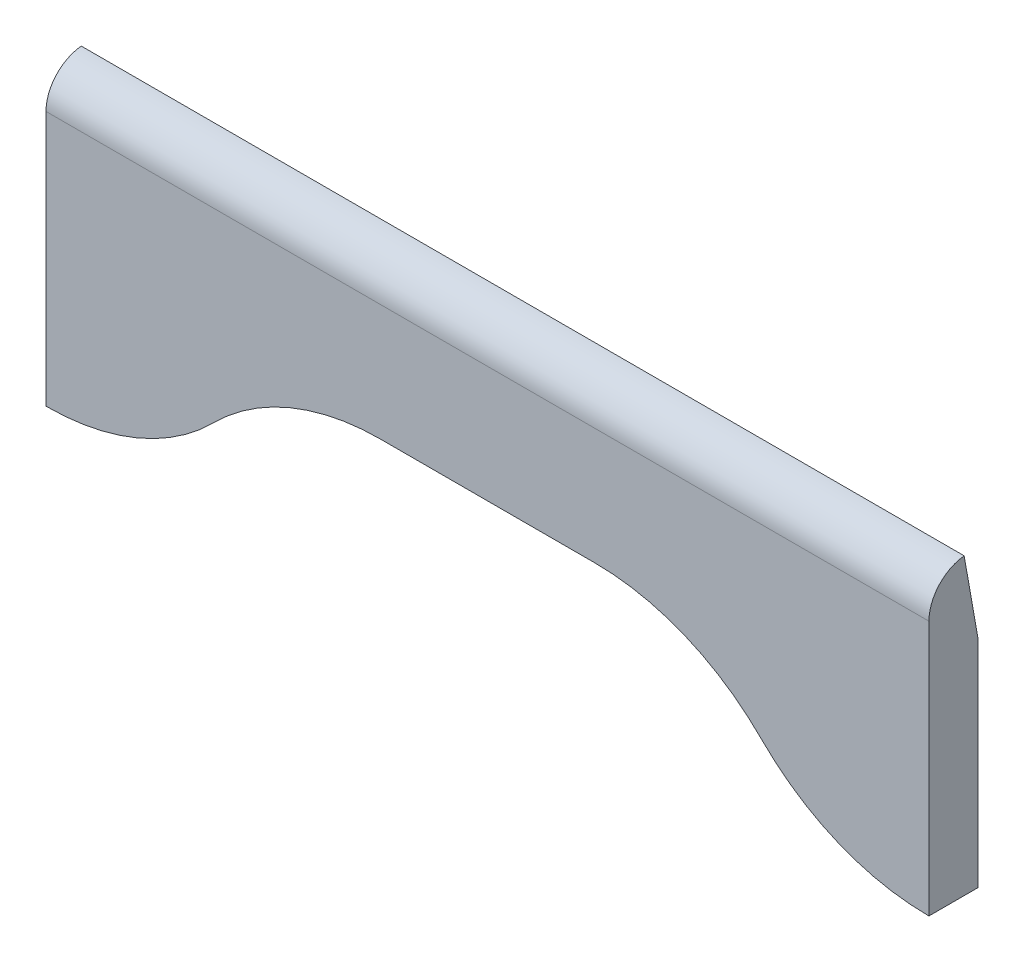
ISO-10303-21;
HEADER;
FILE_DESCRIPTION(('STEP AP214'),'2;1');
FILE_NAME('part.step','',(''),(''),'','','');
FILE_SCHEMA(('AUTOMOTIVE_DESIGN { 1 0 10303 214 1 1 1 1 }'));
ENDSEC;
DATA;
#1=APPLICATION_CONTEXT('core data for automotive mechanical design processes');
#2=APPLICATION_PROTOCOL_DEFINITION('international standard','automotive_design',2000,#1);
#3=PRODUCT_CONTEXT('',#1,'mechanical');
#4=PRODUCT('Part','Part','',(#3));
#5=PRODUCT_RELATED_PRODUCT_CATEGORY('part','',(#4));
#6=PRODUCT_DEFINITION_FORMATION('','',#4);
#7=PRODUCT_DEFINITION_CONTEXT('part definition',#1,'design');
#8=PRODUCT_DEFINITION('design','',#6,#7);
#9=PRODUCT_DEFINITION_SHAPE('','',#8);
#10=(LENGTH_UNIT() NAMED_UNIT(*) SI_UNIT(.MILLI.,.METRE.));
#11=(NAMED_UNIT(*) PLANE_ANGLE_UNIT() SI_UNIT($,.RADIAN.));
#12=(NAMED_UNIT(*) SI_UNIT($,.STERADIAN.) SOLID_ANGLE_UNIT());
#13=UNCERTAINTY_MEASURE_WITH_UNIT(LENGTH_MEASURE(1.E-05),#10,'distance_accuracy_value','');
#14=(GEOMETRIC_REPRESENTATION_CONTEXT(3) GLOBAL_UNCERTAINTY_ASSIGNED_CONTEXT((#13)) GLOBAL_UNIT_ASSIGNED_CONTEXT((#10,
#11,#12)) REPRESENTATION_CONTEXT('',''));
#15=CARTESIAN_POINT('',(0.,0.,0.));
#16=DIRECTION('',(0.,0.,1.));
#17=DIRECTION('',(1.,0.,0.));
#18=AXIS2_PLACEMENT_3D('',#15,#16,#17);
#19=CARTESIAN_POINT('',(0.,0.,6.35));
#20=DIRECTION('',(0.,1.,0.));
#21=DIRECTION('',(0.,0.,1.));
#22=AXIS2_PLACEMENT_3D('',#19,#20,#21);
#23=PLANE('',#22);
#24=DIRECTION('',(1.,0.,0.));
#25=VECTOR('',#24,1.);
#26=CARTESIAN_POINT('',(0.,0.,0.));
#27=LINE('',#26,#25);
#28=CARTESIAN_POINT('',(0.,0.,0.));
#29=VERTEX_POINT('',#28);
#30=CARTESIAN_POINT('',(0.0747706188680935,0.,0.));
#31=VERTEX_POINT('',#30);
#32=EDGE_CURVE('E250',#29,#31,#27,.T.);
#33=ORIENTED_EDGE('',*,*,#32,.T.);
#34=DIRECTION('',(0.,0.,1.));
#35=VECTOR('',#34,1.);
#36=CARTESIAN_POINT('',(0.0747706188680935,0.,6.35));
#37=LINE('',#36,#35);
#38=CARTESIAN_POINT('',(0.0747706188680935,0.,6.35));
#39=VERTEX_POINT('',#38);
#40=EDGE_CURVE('E144',#31,#39,#37,.T.);
#41=ORIENTED_EDGE('',*,*,#40,.T.);
#42=DIRECTION('',(1.,0.,0.));
#43=VECTOR('',#42,1.);
#44=CARTESIAN_POINT('',(0.,0.,6.35));
#45=LINE('',#44,#43);
#46=CARTESIAN_POINT('',(0.,0.,6.35));
#47=VERTEX_POINT('',#46);
#48=EDGE_CURVE('E131',#47,#39,#45,.T.);
#49=ORIENTED_EDGE('',*,*,#48,.F.);
#50=DIRECTION('',(0.,0.,-1.));
#51=VECTOR('',#50,1.);
#52=CARTESIAN_POINT('',(0.,0.,6.35));
#53=LINE('',#52,#51);
#54=EDGE_CURVE('E142',#47,#29,#53,.T.);
#55=ORIENTED_EDGE('',*,*,#54,.T.);
#56=EDGE_LOOP('',(#33,#41,#49,#55));
#57=FACE_BOUND('',#56,.T.);
#58=ADVANCED_FACE('F33',(#57),#23,.F.);
#59=CARTESIAN_POINT('',(0.,0.,6.35));
#60=DIRECTION('',(1.,0.,0.));
#61=DIRECTION('',(0.,0.,-1.));
#62=AXIS2_PLACEMENT_3D('',#59,#60,#61);
#63=PLANE('',#62);
#64=DIRECTION('',(0.,-1.,0.));
#65=VECTOR('',#64,1.);
#66=CARTESIAN_POINT('',(0.,0.,6.35));
#67=LINE('',#66,#65);
#68=CARTESIAN_POINT('',(0.,33.0468369911163,6.35));
#69=VERTEX_POINT('',#68);
#70=EDGE_CURVE('E127',#69,#47,#67,.T.);
#71=ORIENTED_EDGE('',*,*,#70,.F.);
#72=CARTESIAN_POINT('',(0.,33.0468369911163,1.27));
#73=DIRECTION('',(1.,0.,0.));
#74=DIRECTION('',(0.,0.,-1.));
#75=AXIS2_PLACEMENT_3D('',#72,#73,#74);
#76=CIRCLE('',#75,5.08);
#77=CARTESIAN_POINT('',(0.,38.1,1.79148212399801));
#78=VERTEX_POINT('',#77);
#79=EDGE_CURVE('E41',#69,#78,#76,.F.);
#80=ORIENTED_EDGE('',*,*,#79,.T.);
#81=DIRECTION('',(0.,-0.984807753012209,-0.173648177666928));
#82=VECTOR('',#81,1.);
#83=CARTESIAN_POINT('',(0.,38.1,1.79148212399801));
#84=LINE('',#83,#82);
#85=CARTESIAN_POINT('',(0.,27.9399999999998,0.));
#86=VERTEX_POINT('',#85);
#87=EDGE_CURVE('E154',#78,#86,#84,.T.);
#88=ORIENTED_EDGE('',*,*,#87,.T.);
#89=DIRECTION('',(0.,-1.,0.));
#90=VECTOR('',#89,1.);
#91=CARTESIAN_POINT('',(0.,0.,0.));
#92=LINE('',#91,#90);
#93=EDGE_CURVE('E149',#86,#29,#92,.T.);
#94=ORIENTED_EDGE('',*,*,#93,.T.);
#95=ORIENTED_EDGE('',*,*,#54,.F.);
#96=EDGE_LOOP('',(#71,#80,#88,#94,#95));
#97=FACE_BOUND('',#96,.T.);
#98=ADVANCED_FACE('F147',(#97),#63,.F.);
#99=CARTESIAN_POINT('',(114.225229381132,0.,6.35));
#100=VERTEX_POINT('',#99);
#101=CARTESIAN_POINT('',(114.3,0.,6.35));
#102=VERTEX_POINT('',#101);
#103=EDGE_CURVE('E135',#100,#102,#45,.T.);
#104=ORIENTED_EDGE('',*,*,#103,.F.);
#105=DIRECTION('',(0.,0.,1.));
#106=VECTOR('',#105,1.);
#107=CARTESIAN_POINT('',(114.225229381132,0.,6.35));
#108=LINE('',#107,#106);
#109=CARTESIAN_POINT('',(114.225229381132,0.,0.));
#110=VERTEX_POINT('',#109);
#111=EDGE_CURVE('E185',#100,#110,#108,.F.);
#112=ORIENTED_EDGE('',*,*,#111,.T.);
#113=CARTESIAN_POINT('',(114.3,0.,0.));
#114=VERTEX_POINT('',#113);
#115=EDGE_CURVE('E248',#110,#114,#27,.T.);
#116=ORIENTED_EDGE('',*,*,#115,.T.);
#117=DIRECTION('',(0.,0.,-1.));
#118=VECTOR('',#117,1.);
#119=CARTESIAN_POINT('',(114.3,0.,6.35));
#120=LINE('',#119,#118);
#121=EDGE_CURVE('E152',#102,#114,#120,.T.);
#122=ORIENTED_EDGE('',*,*,#121,.F.);
#123=EDGE_LOOP('',(#104,#112,#116,#122));
#124=FACE_BOUND('',#123,.T.);
#125=ADVANCED_FACE('F223',(#124),#23,.F.);
#126=CARTESIAN_POINT('',(114.3,0.,6.35));
#127=DIRECTION('',(-1.,0.,0.));
#128=DIRECTION('',(0.,0.,1.));
#129=AXIS2_PLACEMENT_3D('',#126,#127,#128);
#130=PLANE('',#129);
#131=DIRECTION('',(0.,0.984807753012209,0.173648177666928));
#132=VECTOR('',#131,1.);
#133=CARTESIAN_POINT('',(114.3,38.1,1.79148212399801));
#134=LINE('',#133,#132);
#135=CARTESIAN_POINT('',(114.3,27.9399999999991,0.));
#136=VERTEX_POINT('',#135);
#137=CARTESIAN_POINT('',(114.3,38.1,1.79148212399801));
#138=VERTEX_POINT('',#137);
#139=EDGE_CURVE('E163',#136,#138,#134,.T.);
#140=ORIENTED_EDGE('',*,*,#139,.T.);
#141=CARTESIAN_POINT('',(114.3,33.0468369911163,1.27));
#142=DIRECTION('',(-1.,0.,0.));
#143=DIRECTION('',(0.,0.,1.));
#144=AXIS2_PLACEMENT_3D('',#141,#142,#143);
#145=CIRCLE('',#144,5.08);
#146=CARTESIAN_POINT('',(114.3,33.0468369911163,6.35));
#147=VERTEX_POINT('',#146);
#148=EDGE_CURVE('E11',#138,#147,#145,.F.);
#149=ORIENTED_EDGE('',*,*,#148,.T.);
#150=DIRECTION('',(0.,1.,0.));
#151=VECTOR('',#150,1.);
#152=CARTESIAN_POINT('',(114.3,0.,6.35));
#153=LINE('',#152,#151);
#154=EDGE_CURVE('E145',#102,#147,#153,.T.);
#155=ORIENTED_EDGE('',*,*,#154,.F.);
#156=ORIENTED_EDGE('',*,*,#121,.T.);
#157=DIRECTION('',(0.,1.,0.));
#158=VECTOR('',#157,1.);
#159=CARTESIAN_POINT('',(114.3,0.,0.));
#160=LINE('',#159,#158);
#161=EDGE_CURVE('E136',#114,#136,#160,.T.);
#162=ORIENTED_EDGE('',*,*,#161,.T.);
#163=EDGE_LOOP('',(#140,#149,#155,#156,#162));
#164=FACE_BOUND('',#163,.T.);
#165=ADVANCED_FACE('F230',(#164),#130,.F.);
#166=CARTESIAN_POINT('',(0.,0.,6.35));
#167=DIRECTION('',(0.,0.,-1.));
#168=DIRECTION('',(-1.,0.,0.));
#169=AXIS2_PLACEMENT_3D('',#166,#167,#168);
#170=PLANE('',#169);
#171=ORIENTED_EDGE('',*,*,#154,.T.);
#172=DIRECTION('',(1.,0.,0.));
#173=VECTOR('',#172,1.);
#174=CARTESIAN_POINT('',(0.,33.0468369911163,6.35));
#175=LINE('',#174,#173);
#176=EDGE_CURVE('E132',#147,#69,#175,.F.);
#177=ORIENTED_EDGE('',*,*,#176,.T.);
#178=ORIENTED_EDGE('',*,*,#70,.T.);
#179=ORIENTED_EDGE('',*,*,#48,.T.);
#180=CARTESIAN_POINT('',(0.0747706188680935,30.48,6.35));
#181=DIRECTION('',(0.,0.,-1.));
#182=DIRECTION('',(-1.,0.,0.));
#183=AXIS2_PLACEMENT_3D('',#180,#181,#182);
#184=CIRCLE('',#183,30.48);
#185=CARTESIAN_POINT('',(21.627385309434,8.927385309434,6.35));
#186=VERTEX_POINT('',#185);
#187=EDGE_CURVE('E174',#39,#186,#184,.F.);
#188=ORIENTED_EDGE('',*,*,#187,.T.);
#189=DIRECTION('',(-0.707106781186549,-0.707106781186546,0.));
#190=VECTOR('',#189,1.);
#191=CARTESIAN_POINT('',(12.7,0.,6.35));
#192=LINE('',#191,#190);
#193=CARTESIAN_POINT('',(21.7331269327043,9.03312693270428,6.35));
#194=VERTEX_POINT('',#193);
#195=EDGE_CURVE('E252',#194,#186,#192,.T.);
#196=ORIENTED_EDGE('',*,*,#195,.F.);
#197=CARTESIAN_POINT('',(43.2857416232702,-12.5194877578617,6.35));
#198=DIRECTION('',(0.,0.,-1.));
#199=DIRECTION('',(-1.,0.,0.));
#200=AXIS2_PLACEMENT_3D('',#197,#198,#199);
#201=CIRCLE('',#200,30.48);
#202=CARTESIAN_POINT('',(43.2857416232702,17.9605122421383,6.35));
#203=VERTEX_POINT('',#202);
#204=EDGE_CURVE('E204',#194,#203,#201,.T.);
#205=ORIENTED_EDGE('',*,*,#204,.T.);
#206=DIRECTION('',(-1.,0.,0.));
#207=VECTOR('',#206,1.);
#208=CARTESIAN_POINT('',(30.6605122421383,17.9605122421383,6.35));
#209=LINE('',#208,#207);
#210=CARTESIAN_POINT('',(71.0142583767298,17.9605122421383,6.35));
#211=VERTEX_POINT('',#210);
#212=EDGE_CURVE('E257',#211,#203,#209,.T.);
#213=ORIENTED_EDGE('',*,*,#212,.F.);
#214=CARTESIAN_POINT('',(71.0142583767298,-12.5194877578617,6.35));
#215=DIRECTION('',(0.,0.,-1.));
#216=DIRECTION('',(-1.,0.,0.));
#217=AXIS2_PLACEMENT_3D('',#214,#215,#216);
#218=CIRCLE('',#217,30.48);
#219=CARTESIAN_POINT('',(92.5668730672958,9.0331269327042,6.35));
#220=VERTEX_POINT('',#219);
#221=EDGE_CURVE('E200',#211,#220,#218,.T.);
#222=ORIENTED_EDGE('',*,*,#221,.T.);
#223=DIRECTION('',(-0.707106781186546,0.707106781186549,0.));
#224=VECTOR('',#223,1.);
#225=CARTESIAN_POINT('',(83.6394877578618,17.9605122421383,6.35));
#226=LINE('',#225,#224);
#227=CARTESIAN_POINT('',(92.672614690566,8.92738530943407,6.35));
#228=VERTEX_POINT('',#227);
#229=EDGE_CURVE('E260',#228,#220,#226,.T.);
#230=ORIENTED_EDGE('',*,*,#229,.F.);
#231=CARTESIAN_POINT('',(114.225229381132,30.48,6.35));
#232=DIRECTION('',(0.,0.,-1.));
#233=DIRECTION('',(-1.,0.,0.));
#234=AXIS2_PLACEMENT_3D('',#231,#232,#233);
#235=CIRCLE('',#234,30.48);
#236=EDGE_CURVE('E183',#228,#100,#235,.F.);
#237=ORIENTED_EDGE('',*,*,#236,.T.);
#238=ORIENTED_EDGE('',*,*,#103,.T.);
#239=EDGE_LOOP('',(#171,#177,#178,#179,#188,#196,#205,#213,#222,#230,#237,#238));
#240=FACE_BOUND('',#239,.T.);
#241=ADVANCED_FACE('F129',(#240),#170,.F.);
#242=CARTESIAN_POINT('',(0.,0.,0.));
#243=DIRECTION('',(0.,0.,-1.));
#244=DIRECTION('',(-1.,0.,0.));
#245=AXIS2_PLACEMENT_3D('',#242,#243,#244);
#246=PLANE('',#245);
#247=ORIENTED_EDGE('',*,*,#115,.F.);
#248=CARTESIAN_POINT('',(114.225229381132,30.48,0.));
#249=DIRECTION('',(0.,0.,-1.));
#250=DIRECTION('',(-1.,0.,0.));
#251=AXIS2_PLACEMENT_3D('',#248,#249,#250);
#252=CIRCLE('',#251,30.48);
#253=CARTESIAN_POINT('',(92.672614690566,8.92738530943407,0.));
#254=VERTEX_POINT('',#253);
#255=EDGE_CURVE('E187',#110,#254,#252,.T.);
#256=ORIENTED_EDGE('',*,*,#255,.T.);
#257=DIRECTION('',(0.707106781186546,-0.707106781186549,0.));
#258=VECTOR('',#257,1.);
#259=CARTESIAN_POINT('',(50.8000000000002,50.8,0.));
#260=LINE('',#259,#258);
#261=CARTESIAN_POINT('',(92.5668730672958,9.03312693270419,0.));
#262=VERTEX_POINT('',#261);
#263=EDGE_CURVE('E165',#262,#254,#260,.T.);
#264=ORIENTED_EDGE('',*,*,#263,.F.);
#265=CARTESIAN_POINT('',(71.0142583767298,-12.5194877578617,0.));
#266=DIRECTION('',(0.,0.,-1.));
#267=DIRECTION('',(-1.,0.,0.));
#268=AXIS2_PLACEMENT_3D('',#265,#266,#267);
#269=CIRCLE('',#268,30.48);
#270=CARTESIAN_POINT('',(71.0142583767298,17.9605122421383,0.));
#271=VERTEX_POINT('',#270);
#272=EDGE_CURVE('E202',#262,#271,#269,.F.);
#273=ORIENTED_EDGE('',*,*,#272,.T.);
#274=DIRECTION('',(1.,0.,0.));
#275=VECTOR('',#274,1.);
#276=CARTESIAN_POINT('',(0.,17.9605122421383,0.));
#277=LINE('',#276,#275);
#278=CARTESIAN_POINT('',(43.2857416232702,17.9605122421383,0.));
#279=VERTEX_POINT('',#278);
#280=EDGE_CURVE('E167',#279,#271,#277,.T.);
#281=ORIENTED_EDGE('',*,*,#280,.F.);
#282=CARTESIAN_POINT('',(43.2857416232702,-12.5194877578617,0.));
#283=DIRECTION('',(0.,0.,-1.));
#284=DIRECTION('',(-1.,0.,0.));
#285=AXIS2_PLACEMENT_3D('',#282,#283,#284);
#286=CIRCLE('',#285,30.48);
#287=CARTESIAN_POINT('',(21.7331269327043,9.03312693270428,0.));
#288=VERTEX_POINT('',#287);
#289=EDGE_CURVE('E206',#279,#288,#286,.F.);
#290=ORIENTED_EDGE('',*,*,#289,.T.);
#291=DIRECTION('',(0.707106781186549,0.707106781186546,0.));
#292=VECTOR('',#291,1.);
#293=CARTESIAN_POINT('',(6.34999999999998,-6.35,0.));
#294=LINE('',#293,#292);
#295=CARTESIAN_POINT('',(21.627385309434,8.927385309434,0.));
#296=VERTEX_POINT('',#295);
#297=EDGE_CURVE('E170',#296,#288,#294,.T.);
#298=ORIENTED_EDGE('',*,*,#297,.F.);
#299=CARTESIAN_POINT('',(0.0747706188680935,30.48,0.));
#300=DIRECTION('',(0.,0.,-1.));
#301=DIRECTION('',(-1.,0.,0.));
#302=AXIS2_PLACEMENT_3D('',#299,#300,#301);
#303=CIRCLE('',#302,30.48);
#304=EDGE_CURVE('E178',#296,#31,#303,.T.);
#305=ORIENTED_EDGE('',*,*,#304,.T.);
#306=ORIENTED_EDGE('',*,*,#32,.F.);
#307=ORIENTED_EDGE('',*,*,#93,.F.);
#308=DIRECTION('',(1.,0.,0.));
#309=VECTOR('',#308,1.);
#310=CARTESIAN_POINT('',(114.3,27.9399999999998,0.));
#311=LINE('',#310,#309);
#312=EDGE_CURVE('E161',#86,#136,#311,.T.);
#313=ORIENTED_EDGE('',*,*,#312,.T.);
#314=ORIENTED_EDGE('',*,*,#161,.F.);
#315=EDGE_LOOP('',(#247,#256,#264,#273,#281,#290,#298,#305,#306,#307,#313,#314));
#316=FACE_BOUND('',#315,.T.);
#317=ADVANCED_FACE('F245',(#316),#246,.T.);
#318=CARTESIAN_POINT('',(0.,38.1,1.79148212399801));
#319=DIRECTION('',(0.,0.173648177666928,-0.984807753012208));
#320=DIRECTION('',(1.,0.,0.));
#321=AXIS2_PLACEMENT_3D('',#318,#319,#320);
#322=PLANE('',#321);
#323=ORIENTED_EDGE('',*,*,#139,.F.);
#324=ORIENTED_EDGE('',*,*,#312,.F.);
#325=ORIENTED_EDGE('',*,*,#87,.F.);
#326=DIRECTION('',(-1.,0.,0.));
#327=VECTOR('',#326,1.);
#328=CARTESIAN_POINT('',(0.,38.1,1.79148212399801));
#329=LINE('',#328,#327);
#330=EDGE_CURVE('E151',#138,#78,#329,.T.);
#331=ORIENTED_EDGE('',*,*,#330,.F.);
#332=EDGE_LOOP('',(#323,#324,#325,#331));
#333=FACE_BOUND('',#332,.T.);
#334=ADVANCED_FACE('F213',(#333),#322,.T.);
#335=CARTESIAN_POINT('',(12.7,0.,-14.732));
#336=DIRECTION('',(-0.707106781186546,0.707106781186549,0.));
#337=DIRECTION('',(-0.707106781186549,-0.707106781186546,0.));
#338=AXIS2_PLACEMENT_3D('',#335,#336,#337);
#339=PLANE('',#338);
#340=ORIENTED_EDGE('',*,*,#297,.T.);
#341=DIRECTION('',(0.,0.,1.));
#342=VECTOR('',#341,1.);
#343=CARTESIAN_POINT('',(21.7331269327043,9.03312693270428,6.35));
#344=LINE('',#343,#342);
#345=EDGE_CURVE('E197',#288,#194,#344,.T.);
#346=ORIENTED_EDGE('',*,*,#345,.T.);
#347=ORIENTED_EDGE('',*,*,#195,.T.);
#348=DIRECTION('',(0.,0.,1.));
#349=VECTOR('',#348,1.);
#350=CARTESIAN_POINT('',(21.627385309434,8.927385309434,-14.732));
#351=LINE('',#350,#349);
#352=EDGE_CURVE('E176',#186,#296,#351,.F.);
#353=ORIENTED_EDGE('',*,*,#352,.T.);
#354=EDGE_LOOP('',(#340,#346,#347,#353));
#355=FACE_BOUND('',#354,.T.);
#356=ADVANCED_FACE('F278',(#355),#339,.F.);
#357=CARTESIAN_POINT('',(30.6605122421383,17.9605122421383,-14.732));
#358=DIRECTION('',(0.,1.,0.));
#359=DIRECTION('',(0.,0.,1.));
#360=AXIS2_PLACEMENT_3D('',#357,#358,#359);
#361=PLANE('',#360);
#362=ORIENTED_EDGE('',*,*,#280,.T.);
#363=DIRECTION('',(0.,0.,1.));
#364=VECTOR('',#363,1.);
#365=CARTESIAN_POINT('',(71.0142583767298,17.9605122421383,6.35));
#366=LINE('',#365,#364);
#367=EDGE_CURVE('E192',#271,#211,#366,.T.);
#368=ORIENTED_EDGE('',*,*,#367,.T.);
#369=ORIENTED_EDGE('',*,*,#212,.T.);
#370=DIRECTION('',(0.,0.,1.));
#371=VECTOR('',#370,1.);
#372=CARTESIAN_POINT('',(43.2857416232702,17.9605122421383,0.));
#373=LINE('',#372,#371);
#374=EDGE_CURVE('E190',#203,#279,#373,.F.);
#375=ORIENTED_EDGE('',*,*,#374,.T.);
#376=EDGE_LOOP('',(#362,#368,#369,#375));
#377=FACE_BOUND('',#376,.T.);
#378=ADVANCED_FACE('F271',(#377),#361,.F.);
#379=CARTESIAN_POINT('',(83.6394877578618,17.9605122421383,-14.732));
#380=DIRECTION('',(0.707106781186549,0.707106781186546,0.));
#381=DIRECTION('',(-0.707106781186546,0.707106781186549,0.));
#382=AXIS2_PLACEMENT_3D('',#379,#380,#381);
#383=PLANE('',#382);
#384=ORIENTED_EDGE('',*,*,#229,.T.);
#385=DIRECTION('',(0.,0.,1.));
#386=VECTOR('',#385,1.);
#387=CARTESIAN_POINT('',(92.5668730672958,9.0331269327042,0.));
#388=LINE('',#387,#386);
#389=EDGE_CURVE('E195',#220,#262,#388,.F.);
#390=ORIENTED_EDGE('',*,*,#389,.T.);
#391=ORIENTED_EDGE('',*,*,#263,.T.);
#392=DIRECTION('',(0.,0.,1.));
#393=VECTOR('',#392,1.);
#394=CARTESIAN_POINT('',(92.672614690566,8.92738530943407,-14.732));
#395=LINE('',#394,#393);
#396=EDGE_CURVE('E180',#254,#228,#395,.T.);
#397=ORIENTED_EDGE('',*,*,#396,.T.);
#398=EDGE_LOOP('',(#384,#390,#391,#397));
#399=FACE_BOUND('',#398,.T.);
#400=ADVANCED_FACE('F265',(#399),#383,.F.);
#401=CARTESIAN_POINT('',(0.0747706188680935,30.48,6.35));
#402=DIRECTION('',(0.,0.,1.));
#403=DIRECTION('',(1.,0.,0.));
#404=AXIS2_PLACEMENT_3D('',#401,#402,#403);
#405=CYLINDRICAL_SURFACE('',#404,30.48);
#406=ORIENTED_EDGE('',*,*,#304,.F.);
#407=ORIENTED_EDGE('',*,*,#352,.F.);
#408=ORIENTED_EDGE('',*,*,#187,.F.);
#409=ORIENTED_EDGE('',*,*,#40,.F.);
#410=EDGE_LOOP('',(#406,#407,#408,#409));
#411=FACE_BOUND('',#410,.T.);
#412=ADVANCED_FACE('F282',(#411),#405,.T.);
#413=CARTESIAN_POINT('',(114.225229381132,30.48,-14.732));
#414=DIRECTION('',(0.,0.,1.));
#415=DIRECTION('',(1.,0.,0.));
#416=AXIS2_PLACEMENT_3D('',#413,#414,#415);
#417=CYLINDRICAL_SURFACE('',#416,30.48);
#418=ORIENTED_EDGE('',*,*,#255,.F.);
#419=ORIENTED_EDGE('',*,*,#111,.F.);
#420=ORIENTED_EDGE('',*,*,#236,.F.);
#421=ORIENTED_EDGE('',*,*,#396,.F.);
#422=EDGE_LOOP('',(#418,#419,#420,#421));
#423=FACE_BOUND('',#422,.T.);
#424=ADVANCED_FACE('F241',(#423),#417,.T.);
#425=CARTESIAN_POINT('',(71.0142583767298,-12.5194877578617,-14.732));
#426=DIRECTION('',(0.,0.,-1.));
#427=DIRECTION('',(-1.,0.,0.));
#428=AXIS2_PLACEMENT_3D('',#425,#426,#427);
#429=CYLINDRICAL_SURFACE('',#428,30.48);
#430=ORIENTED_EDGE('',*,*,#272,.F.);
#431=ORIENTED_EDGE('',*,*,#389,.F.);
#432=ORIENTED_EDGE('',*,*,#221,.F.);
#433=ORIENTED_EDGE('',*,*,#367,.F.);
#434=EDGE_LOOP('',(#430,#431,#432,#433));
#435=FACE_BOUND('',#434,.T.);
#436=ADVANCED_FACE('F219',(#435),#429,.F.);
#437=CARTESIAN_POINT('',(43.2857416232702,-12.5194877578617,-14.732));
#438=DIRECTION('',(0.,0.,-1.));
#439=DIRECTION('',(-1.,0.,0.));
#440=AXIS2_PLACEMENT_3D('',#437,#438,#439);
#441=CYLINDRICAL_SURFACE('',#440,30.48);
#442=ORIENTED_EDGE('',*,*,#289,.F.);
#443=ORIENTED_EDGE('',*,*,#374,.F.);
#444=ORIENTED_EDGE('',*,*,#204,.F.);
#445=ORIENTED_EDGE('',*,*,#345,.F.);
#446=EDGE_LOOP('',(#442,#443,#444,#445));
#447=FACE_BOUND('',#446,.T.);
#448=ADVANCED_FACE('F215',(#447),#441,.F.);
#449=CARTESIAN_POINT('',(0.,33.0468369911163,1.27));
#450=DIRECTION('',(1.,0.,0.));
#451=DIRECTION('',(0.,0.,-1.));
#452=AXIS2_PLACEMENT_3D('',#449,#450,#451);
#453=CYLINDRICAL_SURFACE('',#452,5.08);
#454=ORIENTED_EDGE('',*,*,#148,.F.);
#455=ORIENTED_EDGE('',*,*,#330,.T.);
#456=ORIENTED_EDGE('',*,*,#79,.F.);
#457=ORIENTED_EDGE('',*,*,#176,.F.);
#458=EDGE_LOOP('',(#454,#455,#456,#457));
#459=FACE_BOUND('',#458,.T.);
#460=ADVANCED_FACE('F35',(#459),#453,.T.);
#461=CLOSED_SHELL('',(#58,#98,#125,#165,#241,#317,#334,#356,#378,#400,#412,#424,#436,#448,#460));
#462=MANIFOLD_SOLID_BREP('B2',#461);
#463=ADVANCED_BREP_SHAPE_REPRESENTATION('',(#18,#462),#14);
#464=SHAPE_DEFINITION_REPRESENTATION(#9,#463);
ENDSEC;
END-ISO-10303-21;
